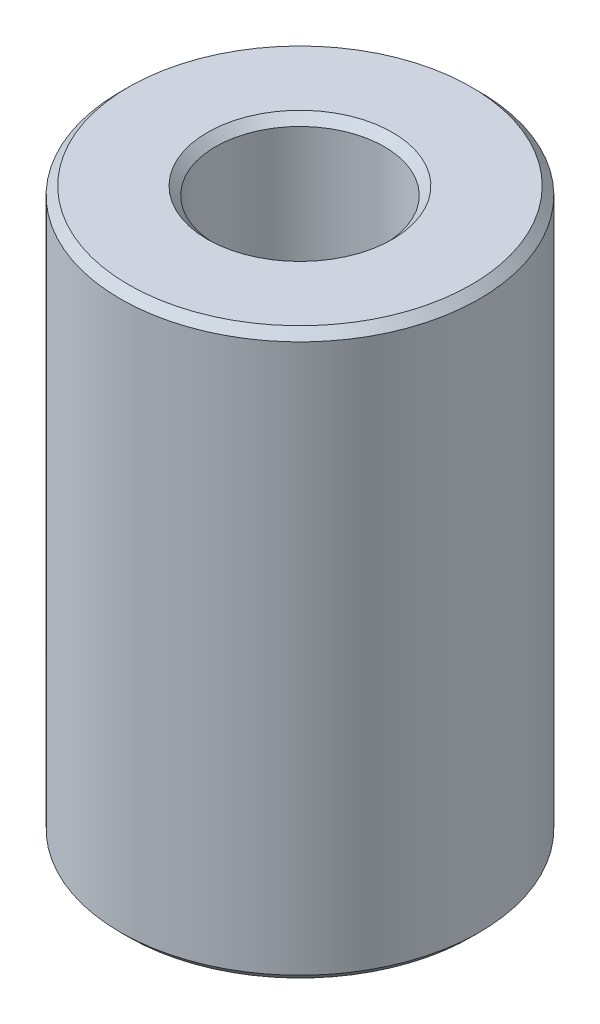
ISO-10303-21;
HEADER;
FILE_DESCRIPTION(('STEP AP214'),'2;1');
FILE_NAME('part.step','',(''),(''),'','','');
FILE_SCHEMA(('AUTOMOTIVE_DESIGN { 1 0 10303 214 1 1 1 1 }'));
ENDSEC;
DATA;
#1=APPLICATION_CONTEXT('core data for automotive mechanical design processes');
#2=APPLICATION_PROTOCOL_DEFINITION('international standard','automotive_design',2000,#1);
#3=PRODUCT_CONTEXT('',#1,'mechanical');
#4=PRODUCT('Part','Part','',(#3));
#5=PRODUCT_RELATED_PRODUCT_CATEGORY('part','',(#4));
#6=PRODUCT_DEFINITION_FORMATION('','',#4);
#7=PRODUCT_DEFINITION_CONTEXT('part definition',#1,'design');
#8=PRODUCT_DEFINITION('design','',#6,#7);
#9=PRODUCT_DEFINITION_SHAPE('','',#8);
#10=(LENGTH_UNIT() NAMED_UNIT(*) SI_UNIT(.MILLI.,.METRE.));
#11=(NAMED_UNIT(*) PLANE_ANGLE_UNIT() SI_UNIT($,.RADIAN.));
#12=(NAMED_UNIT(*) SI_UNIT($,.STERADIAN.) SOLID_ANGLE_UNIT());
#13=UNCERTAINTY_MEASURE_WITH_UNIT(LENGTH_MEASURE(1.E-05),#10,'distance_accuracy_value','');
#14=(GEOMETRIC_REPRESENTATION_CONTEXT(3) GLOBAL_UNCERTAINTY_ASSIGNED_CONTEXT((#13)) GLOBAL_UNIT_ASSIGNED_CONTEXT((#10,
#11,#12)) REPRESENTATION_CONTEXT('',''));
#15=CARTESIAN_POINT('',(0.,0.,0.));
#16=DIRECTION('',(0.,0.,1.));
#17=DIRECTION('',(1.,0.,0.));
#18=AXIS2_PLACEMENT_3D('',#15,#16,#17);
#19=CARTESIAN_POINT('',(0.,149.480980754886,0.));
#20=DIRECTION('',(0.,-1.,0.));
#21=DIRECTION('',(0.,0.,-1.));
#22=AXIS2_PLACEMENT_3D('',#19,#20,#21);
#23=CYLINDRICAL_SURFACE('',#22,47.5);
#24=CARTESIAN_POINT('',(0.,2.17098894181428,0.));
#25=DIRECTION('',(0.,1.,0.));
#26=DIRECTION('',(0.,0.,1.));
#27=AXIS2_PLACEMENT_3D('',#24,#25,#26);
#28=CIRCLE('',#27,47.5);
#29=CARTESIAN_POINT('',(0.,2.17098894181428,47.5));
#30=VERTEX_POINT('',#29);
#31=EDGE_CURVE('E10',#30,#30,#28,.T.);
#32=ORIENTED_EDGE('',*,*,#31,.T.);
#33=EDGE_LOOP('',(#32));
#34=FACE_BOUND('',#33,.T.);
#35=CARTESIAN_POINT('',(0.,147.309991813072,0.));
#36=DIRECTION('',(0.,1.,0.));
#37=DIRECTION('',(0.,0.,1.));
#38=AXIS2_PLACEMENT_3D('',#35,#36,#37);
#39=CIRCLE('',#38,47.5);
#40=CARTESIAN_POINT('',(0.,147.309991813072,47.5));
#41=VERTEX_POINT('',#40);
#42=EDGE_CURVE('E50',#41,#41,#39,.F.);
#43=ORIENTED_EDGE('',*,*,#42,.T.);
#44=EDGE_LOOP('',(#43));
#45=FACE_BOUND('',#44,.T.);
#46=ADVANCED_FACE('F39',(#34,#45),#23,.T.);
#47=CARTESIAN_POINT('',(0.,149.480980754886,0.));
#48=DIRECTION('',(0.,1.,0.));
#49=DIRECTION('',(0.,0.,1.));
#50=AXIS2_PLACEMENT_3D('',#47,#48,#49);
#51=PLANE('',#50);
#52=CARTESIAN_POINT('',(0.,149.480980754886,0.));
#53=DIRECTION('',(0.,1.,0.));
#54=DIRECTION('',(0.,0.,1.));
#55=AXIS2_PLACEMENT_3D('',#52,#53,#54);
#56=CIRCLE('',#55,24.5015939222721);
#57=CARTESIAN_POINT('',(0.,149.480980754886,24.5015939222721));
#58=VERTEX_POINT('',#57);
#59=EDGE_CURVE('E58',#58,#58,#56,.F.);
#60=ORIENTED_EDGE('',*,*,#59,.T.);
#61=EDGE_LOOP('',(#60));
#62=FACE_BOUND('',#61,.T.);
#63=CARTESIAN_POINT('',(0.,149.480980754886,0.));
#64=DIRECTION('',(0.,1.,0.));
#65=DIRECTION('',(0.,0.,1.));
#66=AXIS2_PLACEMENT_3D('',#63,#64,#65);
#67=CIRCLE('',#66,45.3290110581857);
#68=CARTESIAN_POINT('',(0.,149.480980754886,45.3290110581857));
#69=VERTEX_POINT('',#68);
#70=EDGE_CURVE('E61',#69,#69,#67,.T.);
#71=ORIENTED_EDGE('',*,*,#70,.T.);
#72=EDGE_LOOP('',(#71));
#73=FACE_BOUND('',#72,.T.);
#74=ADVANCED_FACE('F88',(#62,#73),#51,.T.);
#75=CARTESIAN_POINT('',(0.,0.,0.));
#76=DIRECTION('',(0.,1.,0.));
#77=DIRECTION('',(0.,0.,1.));
#78=AXIS2_PLACEMENT_3D('',#75,#76,#77);
#79=PLANE('',#78);
#80=CARTESIAN_POINT('',(0.,0.,0.));
#81=DIRECTION('',(0.,1.,0.));
#82=DIRECTION('',(0.,0.,1.));
#83=AXIS2_PLACEMENT_3D('',#80,#81,#82);
#84=CIRCLE('',#83,24.5015939222722);
#85=CARTESIAN_POINT('',(0.,0.,24.5015939222722));
#86=VERTEX_POINT('',#85);
#87=EDGE_CURVE('E51',#86,#86,#84,.T.);
#88=ORIENTED_EDGE('',*,*,#87,.T.);
#89=EDGE_LOOP('',(#88));
#90=FACE_BOUND('',#89,.T.);
#91=CARTESIAN_POINT('',(0.,0.,0.));
#92=DIRECTION('',(0.,1.,0.));
#93=DIRECTION('',(0.,0.,1.));
#94=AXIS2_PLACEMENT_3D('',#91,#92,#93);
#95=CIRCLE('',#94,45.3290110581857);
#96=CARTESIAN_POINT('',(0.,0.,45.3290110581857));
#97=VERTEX_POINT('',#96);
#98=EDGE_CURVE('E54',#97,#97,#95,.F.);
#99=ORIENTED_EDGE('',*,*,#98,.T.);
#100=EDGE_LOOP('',(#99));
#101=FACE_BOUND('',#100,.T.);
#102=ADVANCED_FACE('F83',(#90,#101),#79,.F.);
#103=CARTESIAN_POINT('',(0.,149.480980754886,0.));
#104=DIRECTION('',(0.,-1.,0.));
#105=DIRECTION('',(0.,0.,-1.));
#106=AXIS2_PLACEMENT_3D('',#103,#104,#105);
#107=CYLINDRICAL_SURFACE('',#106,22.3306049804579);
#108=CARTESIAN_POINT('',(0.,147.309991813072,0.));
#109=DIRECTION('',(0.,1.,0.));
#110=DIRECTION('',(0.,0.,1.));
#111=AXIS2_PLACEMENT_3D('',#108,#109,#110);
#112=CIRCLE('',#111,22.3306049804579);
#113=CARTESIAN_POINT('',(0.,147.309991813072,22.3306049804579));
#114=VERTEX_POINT('',#113);
#115=EDGE_CURVE('E67',#114,#114,#112,.T.);
#116=ORIENTED_EDGE('',*,*,#115,.T.);
#117=EDGE_LOOP('',(#116));
#118=FACE_BOUND('',#117,.T.);
#119=CARTESIAN_POINT('',(0.,2.17098894181428,0.));
#120=DIRECTION('',(0.,1.,0.));
#121=DIRECTION('',(0.,0.,1.));
#122=AXIS2_PLACEMENT_3D('',#119,#120,#121);
#123=CIRCLE('',#122,22.3306049804579);
#124=CARTESIAN_POINT('',(0.,2.17098894181428,22.3306049804579));
#125=VERTEX_POINT('',#124);
#126=EDGE_CURVE('E69',#125,#125,#123,.F.);
#127=ORIENTED_EDGE('',*,*,#126,.T.);
#128=EDGE_LOOP('',(#127));
#129=FACE_BOUND('',#128,.T.);
#130=ADVANCED_FACE('F71',(#118,#129),#107,.F.);
#131=CARTESIAN_POINT('',(0.,147.309991813072,0.));
#132=DIRECTION('',(0.,1.,0.));
#133=DIRECTION('',(0.,0.,1.));
#134=AXIS2_PLACEMENT_3D('',#131,#132,#133);
#135=CONICAL_SURFACE('',#134,22.3306049804579,0.78539816339745);
#136=ORIENTED_EDGE('',*,*,#59,.F.);
#137=EDGE_LOOP('',(#136));
#138=FACE_BOUND('',#137,.T.);
#139=ORIENTED_EDGE('',*,*,#115,.F.);
#140=EDGE_LOOP('',(#139));
#141=FACE_BOUND('',#140,.T.);
#142=ADVANCED_FACE('F77',(#138,#141),#135,.F.);
#143=CARTESIAN_POINT('',(0.,0.,0.));
#144=DIRECTION('',(0.,-1.,0.));
#145=DIRECTION('',(0.,0.,-1.));
#146=AXIS2_PLACEMENT_3D('',#143,#144,#145);
#147=CONICAL_SURFACE('',#146,24.5015939222722,0.785398163397441);
#148=ORIENTED_EDGE('',*,*,#126,.F.);
#149=EDGE_LOOP('',(#148));
#150=FACE_BOUND('',#149,.T.);
#151=ORIENTED_EDGE('',*,*,#87,.F.);
#152=EDGE_LOOP('',(#151));
#153=FACE_BOUND('',#152,.T.);
#154=ADVANCED_FACE('F73',(#150,#153),#147,.F.);
#155=CARTESIAN_POINT('',(0.,2.17098894181428,0.));
#156=DIRECTION('',(0.,1.,0.));
#157=DIRECTION('',(0.,0.,1.));
#158=AXIS2_PLACEMENT_3D('',#155,#156,#157);
#159=CONICAL_SURFACE('',#158,47.5,0.785398163397447);
#160=ORIENTED_EDGE('',*,*,#98,.F.);
#161=EDGE_LOOP('',(#160));
#162=FACE_BOUND('',#161,.T.);
#163=ORIENTED_EDGE('',*,*,#31,.F.);
#164=EDGE_LOOP('',(#163));
#165=FACE_BOUND('',#164,.T.);
#166=ADVANCED_FACE('F76',(#162,#165),#159,.T.);
#167=CARTESIAN_POINT('',(0.,149.480980754886,0.));
#168=DIRECTION('',(0.,-1.,0.));
#169=DIRECTION('',(0.,0.,-1.));
#170=AXIS2_PLACEMENT_3D('',#167,#168,#169);
#171=CONICAL_SURFACE('',#170,45.3290110581857,0.78539816339744);
#172=ORIENTED_EDGE('',*,*,#42,.F.);
#173=EDGE_LOOP('',(#172));
#174=FACE_BOUND('',#173,.T.);
#175=ORIENTED_EDGE('',*,*,#70,.F.);
#176=EDGE_LOOP('',(#175));
#177=FACE_BOUND('',#176,.T.);
#178=ADVANCED_FACE('F45',(#174,#177),#171,.T.);
#179=CLOSED_SHELL('',(#46,#74,#102,#130,#142,#154,#166,#178));
#180=MANIFOLD_SOLID_BREP('B2',#179);
#181=ADVANCED_BREP_SHAPE_REPRESENTATION('',(#18,#180),#14);
#182=SHAPE_DEFINITION_REPRESENTATION(#9,#181);
ENDSEC;
END-ISO-10303-21;
